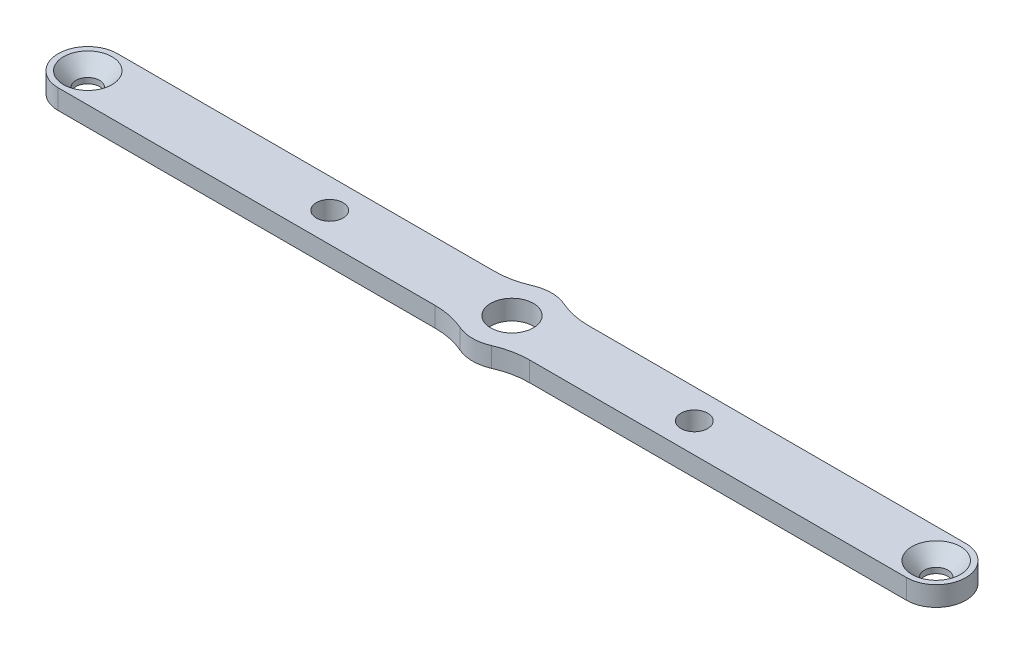
ISO-10303-21;
HEADER;
FILE_DESCRIPTION(('STEP AP214'),'2;1');
FILE_NAME('part.step','',(''),(''),'','','');
FILE_SCHEMA(('AUTOMOTIVE_DESIGN { 1 0 10303 214 1 1 1 1 }'));
ENDSEC;
DATA;
#1=APPLICATION_CONTEXT('core data for automotive mechanical design processes');
#2=APPLICATION_PROTOCOL_DEFINITION('international standard','automotive_design',2000,#1);
#3=PRODUCT_CONTEXT('',#1,'mechanical');
#4=PRODUCT('Part','Part','',(#3));
#5=PRODUCT_RELATED_PRODUCT_CATEGORY('part','',(#4));
#6=PRODUCT_DEFINITION_FORMATION('','',#4);
#7=PRODUCT_DEFINITION_CONTEXT('part definition',#1,'design');
#8=PRODUCT_DEFINITION('design','',#6,#7);
#9=PRODUCT_DEFINITION_SHAPE('','',#8);
#10=(LENGTH_UNIT() NAMED_UNIT(*) SI_UNIT(.MILLI.,.METRE.));
#11=(NAMED_UNIT(*) PLANE_ANGLE_UNIT() SI_UNIT($,.RADIAN.));
#12=(NAMED_UNIT(*) SI_UNIT($,.STERADIAN.) SOLID_ANGLE_UNIT());
#13=UNCERTAINTY_MEASURE_WITH_UNIT(LENGTH_MEASURE(1.E-05),#10,'distance_accuracy_value','');
#14=(GEOMETRIC_REPRESENTATION_CONTEXT(3) GLOBAL_UNCERTAINTY_ASSIGNED_CONTEXT((#13)) GLOBAL_UNIT_ASSIGNED_CONTEXT((#10,
#11,#12)) REPRESENTATION_CONTEXT('',''));
#15=CARTESIAN_POINT('',(0.,0.,0.));
#16=DIRECTION('',(0.,0.,1.));
#17=DIRECTION('',(1.,0.,0.));
#18=AXIS2_PLACEMENT_3D('',#15,#16,#17);
#19=CARTESIAN_POINT('',(-68.2625000000001,3.175,0.));
#20=DIRECTION('',(0.,-1.,0.));
#21=DIRECTION('',(0.,0.,-1.));
#22=AXIS2_PLACEMENT_3D('',#19,#20,#21);
#23=CYLINDRICAL_SURFACE('',#22,1.90500000000001);
#24=CARTESIAN_POINT('',(-68.2625000000001,0.881280432842019,0.));
#25=DIRECTION('',(0.,1.,0.));
#26=DIRECTION('',(0.,0.,1.));
#27=AXIS2_PLACEMENT_3D('',#24,#25,#26);
#28=CIRCLE('',#27,1.90500000000001);
#29=CARTESIAN_POINT('',(-68.2625000000001,0.881280432842019,1.90500000000001));
#30=VERTEX_POINT('',#29);
#31=EDGE_CURVE('E422',#30,#30,#28,.F.);
#32=ORIENTED_EDGE('',*,*,#31,.F.);
#33=EDGE_LOOP('',(#32));
#34=FACE_BOUND('',#33,.T.);
#35=CARTESIAN_POINT('',(-68.2625000000001,0.,0.));
#36=DIRECTION('',(0.,1.,0.));
#37=DIRECTION('',(0.,0.,1.));
#38=AXIS2_PLACEMENT_3D('',#35,#36,#37);
#39=CIRCLE('',#38,1.90500000000001);
#40=CARTESIAN_POINT('',(-68.2625000000001,0.,1.90500000000001));
#41=VERTEX_POINT('',#40);
#42=EDGE_CURVE('E444',#41,#41,#39,.T.);
#43=ORIENTED_EDGE('',*,*,#42,.F.);
#44=EDGE_LOOP('',(#43));
#45=FACE_BOUND('',#44,.T.);
#46=ADVANCED_FACE('F283',(#34,#45),#23,.F.);
#47=CARTESIAN_POINT('',(-29.337,3.175,0.));
#48=DIRECTION('',(0.,-1.,0.));
#49=DIRECTION('',(0.,0.,-1.));
#50=AXIS2_PLACEMENT_3D('',#47,#48,#49);
#51=CYLINDRICAL_SURFACE('',#50,2.15172289740133);
#52=CARTESIAN_POINT('',(-29.337,3.175,0.));
#53=DIRECTION('',(0.,1.,0.));
#54=DIRECTION('',(0.,0.,1.));
#55=AXIS2_PLACEMENT_3D('',#52,#53,#54);
#56=CIRCLE('',#55,2.15172289740133);
#57=CARTESIAN_POINT('',(-29.337,3.175,2.15172289740133));
#58=VERTEX_POINT('',#57);
#59=EDGE_CURVE('E411',#58,#58,#56,.T.);
#60=ORIENTED_EDGE('',*,*,#59,.T.);
#61=EDGE_LOOP('',(#60));
#62=FACE_BOUND('',#61,.T.);
#63=CARTESIAN_POINT('',(-29.337,0.,0.));
#64=DIRECTION('',(0.,1.,0.));
#65=DIRECTION('',(0.,0.,1.));
#66=AXIS2_PLACEMENT_3D('',#63,#64,#65);
#67=CIRCLE('',#66,2.15172289740133);
#68=CARTESIAN_POINT('',(-29.337,0.,2.15172289740133));
#69=VERTEX_POINT('',#68);
#70=EDGE_CURVE('E441',#69,#69,#67,.T.);
#71=ORIENTED_EDGE('',*,*,#70,.F.);
#72=EDGE_LOOP('',(#71));
#73=FACE_BOUND('',#72,.T.);
#74=ADVANCED_FACE('F525',(#62,#73),#51,.F.);
#75=CARTESIAN_POINT('',(0.,3.175,0.));
#76=DIRECTION('',(0.,-1.,0.));
#77=DIRECTION('',(0.,0.,-1.));
#78=AXIS2_PLACEMENT_3D('',#75,#76,#77);
#79=CYLINDRICAL_SURFACE('',#78,3.429);
#80=CARTESIAN_POINT('',(0.,3.175,0.));
#81=DIRECTION('',(0.,1.,0.));
#82=DIRECTION('',(0.,0.,1.));
#83=AXIS2_PLACEMENT_3D('',#80,#81,#82);
#84=CIRCLE('',#83,3.429);
#85=CARTESIAN_POINT('',(0.,3.175,3.429));
#86=VERTEX_POINT('',#85);
#87=EDGE_CURVE('E453',#86,#86,#84,.T.);
#88=ORIENTED_EDGE('',*,*,#87,.T.);
#89=EDGE_LOOP('',(#88));
#90=FACE_BOUND('',#89,.T.);
#91=CARTESIAN_POINT('',(0.,0.,0.));
#92=DIRECTION('',(0.,1.,0.));
#93=DIRECTION('',(0.,0.,1.));
#94=AXIS2_PLACEMENT_3D('',#91,#92,#93);
#95=CIRCLE('',#94,3.429);
#96=CARTESIAN_POINT('',(0.,0.,3.429));
#97=VERTEX_POINT('',#96);
#98=EDGE_CURVE('E418',#97,#97,#95,.T.);
#99=ORIENTED_EDGE('',*,*,#98,.F.);
#100=EDGE_LOOP('',(#99));
#101=FACE_BOUND('',#100,.T.);
#102=ADVANCED_FACE('F531',(#90,#101),#79,.F.);
#103=CARTESIAN_POINT('',(68.2625000000001,3.175,0.));
#104=DIRECTION('',(0.,-1.,0.));
#105=DIRECTION('',(0.,0.,-1.));
#106=AXIS2_PLACEMENT_3D('',#103,#104,#105);
#107=CYLINDRICAL_SURFACE('',#106,1.90500000000001);
#108=CARTESIAN_POINT('',(68.2625000000001,0.881280432842019,0.));
#109=DIRECTION('',(0.,1.,0.));
#110=DIRECTION('',(0.,0.,1.));
#111=AXIS2_PLACEMENT_3D('',#108,#109,#110);
#112=CIRCLE('',#111,1.90500000000001);
#113=CARTESIAN_POINT('',(68.2625000000001,0.881280432842019,1.90500000000001));
#114=VERTEX_POINT('',#113);
#115=EDGE_CURVE('E594',#114,#114,#112,.T.);
#116=ORIENTED_EDGE('',*,*,#115,.T.);
#117=EDGE_LOOP('',(#116));
#118=FACE_BOUND('',#117,.T.);
#119=CARTESIAN_POINT('',(68.2625000000001,0.,0.));
#120=DIRECTION('',(0.,1.,0.));
#121=DIRECTION('',(0.,0.,1.));
#122=AXIS2_PLACEMENT_3D('',#119,#120,#121);
#123=CIRCLE('',#122,1.90500000000001);
#124=CARTESIAN_POINT('',(68.2625000000001,0.,1.90500000000001));
#125=VERTEX_POINT('',#124);
#126=EDGE_CURVE('E450',#125,#125,#123,.F.);
#127=ORIENTED_EDGE('',*,*,#126,.T.);
#128=EDGE_LOOP('',(#127));
#129=FACE_BOUND('',#128,.T.);
#130=ADVANCED_FACE('F560',(#118,#129),#107,.F.);
#131=CARTESIAN_POINT('',(29.337,3.175,0.));
#132=DIRECTION('',(0.,-1.,0.));
#133=DIRECTION('',(0.,0.,-1.));
#134=AXIS2_PLACEMENT_3D('',#131,#132,#133);
#135=CYLINDRICAL_SURFACE('',#134,2.15172289740133);
#136=CARTESIAN_POINT('',(29.337,3.175,0.));
#137=DIRECTION('',(0.,1.,0.));
#138=DIRECTION('',(0.,0.,1.));
#139=AXIS2_PLACEMENT_3D('',#136,#137,#138);
#140=CIRCLE('',#139,2.15172289740133);
#141=CARTESIAN_POINT('',(29.337,3.175,2.15172289740133));
#142=VERTEX_POINT('',#141);
#143=EDGE_CURVE('E414',#142,#142,#140,.F.);
#144=ORIENTED_EDGE('',*,*,#143,.F.);
#145=EDGE_LOOP('',(#144));
#146=FACE_BOUND('',#145,.T.);
#147=CARTESIAN_POINT('',(29.337,0.,0.));
#148=DIRECTION('',(0.,1.,0.));
#149=DIRECTION('',(0.,0.,1.));
#150=AXIS2_PLACEMENT_3D('',#147,#148,#149);
#151=CIRCLE('',#150,2.15172289740133);
#152=CARTESIAN_POINT('',(29.337,0.,2.15172289740133));
#153=VERTEX_POINT('',#152);
#154=EDGE_CURVE('E447',#153,#153,#151,.F.);
#155=ORIENTED_EDGE('',*,*,#154,.T.);
#156=EDGE_LOOP('',(#155));
#157=FACE_BOUND('',#156,.T.);
#158=ADVANCED_FACE('F537',(#146,#157),#135,.F.);
#159=CARTESIAN_POINT('',(0.,3.175,-4.76250000000001));
#160=DIRECTION('',(0.,0.,-1.));
#161=DIRECTION('',(-1.,0.,0.));
#162=AXIS2_PLACEMENT_3D('',#159,#160,#161);
#163=PLANE('',#162);
#164=DIRECTION('',(1.,0.,0.));
#165=VECTOR('',#164,1.);
#166=CARTESIAN_POINT('',(0.,3.175,-4.76250000000001));
#167=LINE('',#166,#165);
#168=CARTESIAN_POINT('',(-68.2625000000001,3.175,-4.7625));
#169=VERTEX_POINT('',#168);
#170=CARTESIAN_POINT('',(-7.6133825432589,3.175,-4.76250000000001));
#171=VERTEX_POINT('',#170);
#172=EDGE_CURVE('E406',#169,#171,#167,.T.);
#173=ORIENTED_EDGE('',*,*,#172,.T.);
#174=DIRECTION('',(0.,-1.,0.));
#175=VECTOR('',#174,1.);
#176=CARTESIAN_POINT('',(-7.6133825432589,3.175,-4.76250000000001));
#177=LINE('',#176,#175);
#178=CARTESIAN_POINT('',(-7.6133825432589,0.,-4.76250000000001));
#179=VERTEX_POINT('',#178);
#180=EDGE_CURVE('E467',#171,#179,#177,.T.);
#181=ORIENTED_EDGE('',*,*,#180,.T.);
#182=DIRECTION('',(1.,0.,0.));
#183=VECTOR('',#182,1.);
#184=CARTESIAN_POINT('',(0.,0.,-4.76250000000001));
#185=LINE('',#184,#183);
#186=CARTESIAN_POINT('',(-68.2625000000001,0.,-4.7625));
#187=VERTEX_POINT('',#186);
#188=EDGE_CURVE('E436',#187,#179,#185,.T.);
#189=ORIENTED_EDGE('',*,*,#188,.F.);
#190=DIRECTION('',(0.,-1.,0.));
#191=VECTOR('',#190,1.);
#192=CARTESIAN_POINT('',(-68.2625000000001,3.175,-4.7625));
#193=LINE('',#192,#191);
#194=EDGE_CURVE('E456',#169,#187,#193,.T.);
#195=ORIENTED_EDGE('',*,*,#194,.F.);
#196=EDGE_LOOP('',(#173,#181,#189,#195));
#197=FACE_BOUND('',#196,.T.);
#198=ADVANCED_FACE('F493',(#197),#163,.T.);
#199=CARTESIAN_POINT('',(0.,3.175,-4.76250000000001));
#200=DIRECTION('',(0.,0.,-1.));
#201=DIRECTION('',(-1.,0.,0.));
#202=AXIS2_PLACEMENT_3D('',#199,#200,#201);
#203=PLANE('',#202);
#204=DIRECTION('',(1.,0.,0.));
#205=VECTOR('',#204,1.);
#206=CARTESIAN_POINT('',(0.,0.,-4.76250000000001));
#207=LINE('',#206,#205);
#208=CARTESIAN_POINT('',(7.6133825432589,0.,-4.76250000000002));
#209=VERTEX_POINT('',#208);
#210=CARTESIAN_POINT('',(68.2625000000001,0.,-4.76250000000003));
#211=VERTEX_POINT('',#210);
#212=EDGE_CURVE('E431',#209,#211,#207,.T.);
#213=ORIENTED_EDGE('',*,*,#212,.F.);
#214=DIRECTION('',(0.,-1.,0.));
#215=VECTOR('',#214,1.);
#216=CARTESIAN_POINT('',(7.6133825432589,3.175,-4.76250000000002));
#217=LINE('',#216,#215);
#218=CARTESIAN_POINT('',(7.6133825432589,3.175,-4.76250000000002));
#219=VERTEX_POINT('',#218);
#220=EDGE_CURVE('E298',#209,#219,#217,.F.);
#221=ORIENTED_EDGE('',*,*,#220,.T.);
#222=DIRECTION('',(1.,0.,0.));
#223=VECTOR('',#222,1.);
#224=CARTESIAN_POINT('',(0.,3.175,-4.76250000000001));
#225=LINE('',#224,#223);
#226=CARTESIAN_POINT('',(68.2625000000001,3.175,-4.76250000000003));
#227=VERTEX_POINT('',#226);
#228=EDGE_CURVE('E398',#219,#227,#225,.T.);
#229=ORIENTED_EDGE('',*,*,#228,.T.);
#230=DIRECTION('',(0.,-1.,0.));
#231=VECTOR('',#230,1.);
#232=CARTESIAN_POINT('',(68.2625000000001,3.175,-4.76250000000003));
#233=LINE('',#232,#231);
#234=EDGE_CURVE('E394',#227,#211,#233,.T.);
#235=ORIENTED_EDGE('',*,*,#234,.T.);
#236=EDGE_LOOP('',(#213,#221,#229,#235));
#237=FACE_BOUND('',#236,.T.);
#238=ADVANCED_FACE('F505',(#237),#203,.T.);
#239=CARTESIAN_POINT('',(68.2625000000001,3.175,0.));
#240=DIRECTION('',(0.,-1.,0.));
#241=DIRECTION('',(0.,0.,-1.));
#242=AXIS2_PLACEMENT_3D('',#239,#240,#241);
#243=CYLINDRICAL_SURFACE('',#242,4.7625);
#244=CARTESIAN_POINT('',(68.2625000000001,0.,0.));
#245=DIRECTION('',(0.,1.,0.));
#246=DIRECTION('',(0.,0.,1.));
#247=AXIS2_PLACEMENT_3D('',#244,#245,#246);
#248=CIRCLE('',#247,4.7625);
#249=CARTESIAN_POINT('',(68.2625000000001,0.,4.76249999999998));
#250=VERTEX_POINT('',#249);
#251=EDGE_CURVE('E429',#250,#211,#248,.T.);
#252=ORIENTED_EDGE('',*,*,#251,.T.);
#253=ORIENTED_EDGE('',*,*,#234,.F.);
#254=CARTESIAN_POINT('',(68.2625000000001,3.175,0.));
#255=DIRECTION('',(0.,1.,0.));
#256=DIRECTION('',(0.,0.,1.));
#257=AXIS2_PLACEMENT_3D('',#254,#255,#256);
#258=CIRCLE('',#257,4.7625);
#259=CARTESIAN_POINT('',(68.2625000000001,3.175,4.76249999999998));
#260=VERTEX_POINT('',#259);
#261=EDGE_CURVE('E375',#260,#227,#258,.T.);
#262=ORIENTED_EDGE('',*,*,#261,.F.);
#263=DIRECTION('',(0.,-1.,0.));
#264=VECTOR('',#263,1.);
#265=CARTESIAN_POINT('',(68.2625000000001,3.175,4.76249999999998));
#266=LINE('',#265,#264);
#267=EDGE_CURVE('E386',#260,#250,#266,.T.);
#268=ORIENTED_EDGE('',*,*,#267,.T.);
#269=EDGE_LOOP('',(#252,#253,#262,#268));
#270=FACE_BOUND('',#269,.T.);
#271=ADVANCED_FACE('F396',(#270),#243,.T.);
#272=CARTESIAN_POINT('',(0.,3.175,4.76249999999999));
#273=DIRECTION('',(0.,0.,-1.));
#274=DIRECTION('',(-1.,0.,0.));
#275=AXIS2_PLACEMENT_3D('',#272,#273,#274);
#276=PLANE('',#275);
#277=DIRECTION('',(1.,0.,0.));
#278=VECTOR('',#277,1.);
#279=CARTESIAN_POINT('',(0.,0.,4.76249999999999));
#280=LINE('',#279,#278);
#281=CARTESIAN_POINT('',(-68.2625000000001,0.,4.7625));
#282=VERTEX_POINT('',#281);
#283=CARTESIAN_POINT('',(-7.61338254325898,0.,4.76249999999999));
#284=VERTEX_POINT('',#283);
#285=EDGE_CURVE('E421',#282,#284,#280,.T.);
#286=ORIENTED_EDGE('',*,*,#285,.T.);
#287=DIRECTION('',(0.,1.,0.));
#288=VECTOR('',#287,1.);
#289=CARTESIAN_POINT('',(-7.61338254325898,3.175,4.76249999999999));
#290=LINE('',#289,#288);
#291=CARTESIAN_POINT('',(-7.61338254325898,3.175,4.76249999999999));
#292=VERTEX_POINT('',#291);
#293=EDGE_CURVE('E463',#284,#292,#290,.T.);
#294=ORIENTED_EDGE('',*,*,#293,.T.);
#295=DIRECTION('',(1.,0.,0.));
#296=VECTOR('',#295,1.);
#297=CARTESIAN_POINT('',(0.,3.175,4.76249999999999));
#298=LINE('',#297,#296);
#299=CARTESIAN_POINT('',(-68.2625000000001,3.175,4.7625));
#300=VERTEX_POINT('',#299);
#301=EDGE_CURVE('E604',#300,#292,#298,.T.);
#302=ORIENTED_EDGE('',*,*,#301,.F.);
#303=DIRECTION('',(0.,-1.,0.));
#304=VECTOR('',#303,1.);
#305=CARTESIAN_POINT('',(-68.2625000000001,3.175,4.7625));
#306=LINE('',#305,#304);
#307=EDGE_CURVE('E417',#300,#282,#306,.T.);
#308=ORIENTED_EDGE('',*,*,#307,.T.);
#309=EDGE_LOOP('',(#286,#294,#302,#308));
#310=FACE_BOUND('',#309,.T.);
#311=ADVANCED_FACE('F551',(#310),#276,.F.);
#312=CARTESIAN_POINT('',(0.,3.175,4.76249999999999));
#313=DIRECTION('',(0.,0.,-1.));
#314=DIRECTION('',(-1.,0.,0.));
#315=AXIS2_PLACEMENT_3D('',#312,#313,#314);
#316=PLANE('',#315);
#317=DIRECTION('',(1.,0.,0.));
#318=VECTOR('',#317,1.);
#319=CARTESIAN_POINT('',(0.,3.175,4.76249999999999));
#320=LINE('',#319,#318);
#321=CARTESIAN_POINT('',(7.61338254325898,3.175,4.76249999999999));
#322=VERTEX_POINT('',#321);
#323=EDGE_CURVE('E370',#322,#260,#320,.T.);
#324=ORIENTED_EDGE('',*,*,#323,.F.);
#325=DIRECTION('',(0.,1.,0.));
#326=VECTOR('',#325,1.);
#327=CARTESIAN_POINT('',(7.61338254325898,0.,4.76249999999999));
#328=LINE('',#327,#326);
#329=CARTESIAN_POINT('',(7.61338254325898,0.,4.76249999999999));
#330=VERTEX_POINT('',#329);
#331=EDGE_CURVE('E465',#322,#330,#328,.F.);
#332=ORIENTED_EDGE('',*,*,#331,.T.);
#333=DIRECTION('',(1.,0.,0.));
#334=VECTOR('',#333,1.);
#335=CARTESIAN_POINT('',(0.,0.,4.76249999999999));
#336=LINE('',#335,#334);
#337=EDGE_CURVE('E389',#330,#250,#336,.T.);
#338=ORIENTED_EDGE('',*,*,#337,.T.);
#339=ORIENTED_EDGE('',*,*,#267,.F.);
#340=EDGE_LOOP('',(#324,#332,#338,#339));
#341=FACE_BOUND('',#340,.T.);
#342=ADVANCED_FACE('F387',(#341),#316,.F.);
#343=CARTESIAN_POINT('',(-68.2625000000001,3.175,0.));
#344=DIRECTION('',(0.,-1.,0.));
#345=DIRECTION('',(0.,0.,-1.));
#346=AXIS2_PLACEMENT_3D('',#343,#344,#345);
#347=CYLINDRICAL_SURFACE('',#346,4.7625);
#348=CARTESIAN_POINT('',(-68.2625000000001,0.,0.));
#349=DIRECTION('',(0.,1.,0.));
#350=DIRECTION('',(0.,0.,1.));
#351=AXIS2_PLACEMENT_3D('',#348,#349,#350);
#352=CIRCLE('',#351,4.7625);
#353=EDGE_CURVE('E439',#187,#282,#352,.T.);
#354=ORIENTED_EDGE('',*,*,#353,.T.);
#355=ORIENTED_EDGE('',*,*,#307,.F.);
#356=CARTESIAN_POINT('',(-68.2625000000001,3.175,0.));
#357=DIRECTION('',(0.,1.,0.));
#358=DIRECTION('',(0.,0.,1.));
#359=AXIS2_PLACEMENT_3D('',#356,#357,#358);
#360=CIRCLE('',#359,4.7625);
#361=EDGE_CURVE('E409',#169,#300,#360,.T.);
#362=ORIENTED_EDGE('',*,*,#361,.F.);
#363=ORIENTED_EDGE('',*,*,#194,.T.);
#364=EDGE_LOOP('',(#354,#355,#362,#363));
#365=FACE_BOUND('',#364,.T.);
#366=ADVANCED_FACE('F523',(#365),#347,.T.);
#367=CARTESIAN_POINT('',(0.,3.175,0.));
#368=DIRECTION('',(0.,-1.,0.));
#369=DIRECTION('',(0.,0.,-1.));
#370=AXIS2_PLACEMENT_3D('',#367,#368,#369);
#371=CYLINDRICAL_SURFACE('',#370,6.35);
#372=CARTESIAN_POINT('',(0.,0.,0.));
#373=DIRECTION('',(0.,1.,0.));
#374=DIRECTION('',(0.,0.,1.));
#375=AXIS2_PLACEMENT_3D('',#372,#373,#374);
#376=CIRCLE('',#375,6.35);
#377=CARTESIAN_POINT('',(2.5377941810863,0.,-5.82083333333334));
#378=VERTEX_POINT('',#377);
#379=CARTESIAN_POINT('',(-2.5377941810863,0.,-5.82083333333333));
#380=VERTEX_POINT('',#379);
#381=EDGE_CURVE('E433',#378,#380,#376,.T.);
#382=ORIENTED_EDGE('',*,*,#381,.T.);
#383=DIRECTION('',(0.,-1.,0.));
#384=VECTOR('',#383,1.);
#385=CARTESIAN_POINT('',(-2.5377941810863,3.175,-5.82083333333333));
#386=LINE('',#385,#384);
#387=CARTESIAN_POINT('',(-2.5377941810863,3.175,-5.82083333333333));
#388=VERTEX_POINT('',#387);
#389=EDGE_CURVE('E473',#380,#388,#386,.F.);
#390=ORIENTED_EDGE('',*,*,#389,.T.);
#391=CARTESIAN_POINT('',(0.,3.175,0.));
#392=DIRECTION('',(0.,1.,0.));
#393=DIRECTION('',(0.,0.,1.));
#394=AXIS2_PLACEMENT_3D('',#391,#392,#393);
#395=CIRCLE('',#394,6.35);
#396=CARTESIAN_POINT('',(2.5377941810863,3.175,-5.82083333333334));
#397=VERTEX_POINT('',#396);
#398=EDGE_CURVE('E400',#397,#388,#395,.T.);
#399=ORIENTED_EDGE('',*,*,#398,.F.);
#400=DIRECTION('',(0.,-1.,0.));
#401=VECTOR('',#400,1.);
#402=CARTESIAN_POINT('',(2.5377941810863,3.175,-5.82083333333334));
#403=LINE('',#402,#401);
#404=EDGE_CURVE('E470',#397,#378,#403,.T.);
#405=ORIENTED_EDGE('',*,*,#404,.T.);
#406=EDGE_LOOP('',(#382,#390,#399,#405));
#407=FACE_BOUND('',#406,.T.);
#408=ADVANCED_FACE('F501',(#407),#371,.T.);
#409=CARTESIAN_POINT('',(0.,0.,0.));
#410=DIRECTION('',(0.,1.,0.));
#411=DIRECTION('',(0.,0.,1.));
#412=AXIS2_PLACEMENT_3D('',#409,#410,#411);
#413=PLANE('',#412);
#414=ORIENTED_EDGE('',*,*,#381,.F.);
#415=CARTESIAN_POINT('',(7.6133825432589,0.,-17.4625));
#416=DIRECTION('',(0.,1.,0.));
#417=DIRECTION('',(0.,0.,1.));
#418=AXIS2_PLACEMENT_3D('',#415,#416,#417);
#419=CIRCLE('',#418,12.7);
#420=EDGE_CURVE('E291',#378,#209,#419,.T.);
#421=ORIENTED_EDGE('',*,*,#420,.T.);
#422=ORIENTED_EDGE('',*,*,#212,.T.);
#423=ORIENTED_EDGE('',*,*,#251,.F.);
#424=ORIENTED_EDGE('',*,*,#337,.F.);
#425=CARTESIAN_POINT('',(7.61338254325898,0.,17.4625));
#426=DIRECTION('',(0.,1.,0.));
#427=DIRECTION('',(0.,0.,1.));
#428=AXIS2_PLACEMENT_3D('',#425,#426,#427);
#429=CIRCLE('',#428,12.7);
#430=CARTESIAN_POINT('',(2.53779418108633,0.,5.82083333333333));
#431=VERTEX_POINT('',#430);
#432=EDGE_CURVE('E480',#330,#431,#429,.T.);
#433=ORIENTED_EDGE('',*,*,#432,.T.);
#434=CARTESIAN_POINT('',(0.,0.,0.));
#435=DIRECTION('',(0.,1.,0.));
#436=DIRECTION('',(0.,0.,1.));
#437=AXIS2_PLACEMENT_3D('',#434,#435,#436);
#438=CIRCLE('',#437,6.35);
#439=CARTESIAN_POINT('',(-2.53779418108633,0.,5.82083333333333));
#440=VERTEX_POINT('',#439);
#441=EDGE_CURVE('E425',#440,#431,#438,.T.);
#442=ORIENTED_EDGE('',*,*,#441,.F.);
#443=CARTESIAN_POINT('',(-7.61338254325898,0.,17.4625));
#444=DIRECTION('',(0.,1.,0.));
#445=DIRECTION('',(0.,0.,1.));
#446=AXIS2_PLACEMENT_3D('',#443,#444,#445);
#447=CIRCLE('',#446,12.7);
#448=EDGE_CURVE('E476',#440,#284,#447,.T.);
#449=ORIENTED_EDGE('',*,*,#448,.T.);
#450=ORIENTED_EDGE('',*,*,#285,.F.);
#451=ORIENTED_EDGE('',*,*,#353,.F.);
#452=ORIENTED_EDGE('',*,*,#188,.T.);
#453=CARTESIAN_POINT('',(-7.61338254325891,0.,-17.4625));
#454=DIRECTION('',(0.,1.,0.));
#455=DIRECTION('',(0.,0.,1.));
#456=AXIS2_PLACEMENT_3D('',#453,#454,#455);
#457=CIRCLE('',#456,12.7);
#458=EDGE_CURVE('E483',#179,#380,#457,.T.);
#459=ORIENTED_EDGE('',*,*,#458,.T.);
#460=EDGE_LOOP('',(#414,#421,#422,#423,#424,#433,#442,#449,#450,#451,#452,#459));
#461=FACE_BOUND('',#460,.T.);
#462=ORIENTED_EDGE('',*,*,#126,.F.);
#463=EDGE_LOOP('',(#462));
#464=FACE_BOUND('',#463,.T.);
#465=ORIENTED_EDGE('',*,*,#154,.F.);
#466=EDGE_LOOP('',(#465));
#467=FACE_BOUND('',#466,.T.);
#468=ORIENTED_EDGE('',*,*,#42,.T.);
#469=EDGE_LOOP('',(#468));
#470=FACE_BOUND('',#469,.T.);
#471=ORIENTED_EDGE('',*,*,#70,.T.);
#472=EDGE_LOOP('',(#471));
#473=FACE_BOUND('',#472,.T.);
#474=ORIENTED_EDGE('',*,*,#98,.T.);
#475=EDGE_LOOP('',(#474));
#476=FACE_BOUND('',#475,.T.);
#477=ADVANCED_FACE('F497',(#461,#464,#467,#470,#473,#476),#413,.F.);
#478=CARTESIAN_POINT('',(0.,3.175,0.));
#479=DIRECTION('',(0.,1.,0.));
#480=DIRECTION('',(0.,0.,1.));
#481=AXIS2_PLACEMENT_3D('',#478,#479,#480);
#482=PLANE('',#481);
#483=CARTESIAN_POINT('',(68.2625000000001,3.175,0.));
#484=DIRECTION('',(0.,1.,0.));
#485=DIRECTION('',(0.,0.,-1.));
#486=AXIS2_PLACEMENT_3D('',#483,#484,#485);
#487=CIRCLE('',#486,3.8989);
#488=CARTESIAN_POINT('',(68.2625000000001,3.175,-3.8989));
#489=VERTEX_POINT('',#488);
#490=EDGE_CURVE('E591',#489,#489,#487,.T.);
#491=ORIENTED_EDGE('',*,*,#490,.F.);
#492=EDGE_LOOP('',(#491));
#493=FACE_BOUND('',#492,.T.);
#494=CARTESIAN_POINT('',(-68.2625000000001,3.175,0.));
#495=DIRECTION('',(0.,-1.,0.));
#496=DIRECTION('',(0.,0.,-1.));
#497=AXIS2_PLACEMENT_3D('',#494,#495,#496);
#498=CIRCLE('',#497,3.8989);
#499=CARTESIAN_POINT('',(-68.2625000000001,3.175,-3.8989));
#500=VERTEX_POINT('',#499);
#501=EDGE_CURVE('E595',#500,#500,#498,.T.);
#502=ORIENTED_EDGE('',*,*,#501,.T.);
#503=EDGE_LOOP('',(#502));
#504=FACE_BOUND('',#503,.T.);
#505=ORIENTED_EDGE('',*,*,#228,.F.);
#506=CARTESIAN_POINT('',(7.6133825432589,3.175,-17.4625));
#507=DIRECTION('',(0.,1.,0.));
#508=DIRECTION('',(0.,0.,1.));
#509=AXIS2_PLACEMENT_3D('',#506,#507,#508);
#510=CIRCLE('',#509,12.7);
#511=EDGE_CURVE('E12',#219,#397,#510,.F.);
#512=ORIENTED_EDGE('',*,*,#511,.T.);
#513=ORIENTED_EDGE('',*,*,#398,.T.);
#514=CARTESIAN_POINT('',(-7.61338254325891,3.175,-17.4625));
#515=DIRECTION('',(0.,1.,0.));
#516=DIRECTION('',(0.,0.,1.));
#517=AXIS2_PLACEMENT_3D('',#514,#515,#516);
#518=CIRCLE('',#517,12.7);
#519=EDGE_CURVE('E485',#388,#171,#518,.F.);
#520=ORIENTED_EDGE('',*,*,#519,.T.);
#521=ORIENTED_EDGE('',*,*,#172,.F.);
#522=ORIENTED_EDGE('',*,*,#361,.T.);
#523=ORIENTED_EDGE('',*,*,#301,.T.);
#524=CARTESIAN_POINT('',(-7.61338254325898,3.175,17.4625));
#525=DIRECTION('',(0.,1.,0.));
#526=DIRECTION('',(0.,0.,1.));
#527=AXIS2_PLACEMENT_3D('',#524,#525,#526);
#528=CIRCLE('',#527,12.7);
#529=CARTESIAN_POINT('',(-2.53779418108633,3.175,5.82083333333333));
#530=VERTEX_POINT('',#529);
#531=EDGE_CURVE('E478',#292,#530,#528,.F.);
#532=ORIENTED_EDGE('',*,*,#531,.T.);
#533=CARTESIAN_POINT('',(0.,3.175,0.));
#534=DIRECTION('',(0.,1.,0.));
#535=DIRECTION('',(0.,0.,1.));
#536=AXIS2_PLACEMENT_3D('',#533,#534,#535);
#537=CIRCLE('',#536,6.35);
#538=CARTESIAN_POINT('',(2.53779418108633,3.175,5.82083333333333));
#539=VERTEX_POINT('',#538);
#540=EDGE_CURVE('E383',#530,#539,#537,.T.);
#541=ORIENTED_EDGE('',*,*,#540,.T.);
#542=CARTESIAN_POINT('',(7.61338254325898,3.175,17.4625));
#543=DIRECTION('',(0.,1.,0.));
#544=DIRECTION('',(0.,0.,1.));
#545=AXIS2_PLACEMENT_3D('',#542,#543,#544);
#546=CIRCLE('',#545,12.7);
#547=EDGE_CURVE('E379',#539,#322,#546,.F.);
#548=ORIENTED_EDGE('',*,*,#547,.T.);
#549=ORIENTED_EDGE('',*,*,#323,.T.);
#550=ORIENTED_EDGE('',*,*,#261,.T.);
#551=EDGE_LOOP('',(#505,#512,#513,#520,#521,#522,#523,#532,#541,#548,#549,#550));
#552=FACE_BOUND('',#551,.T.);
#553=ORIENTED_EDGE('',*,*,#87,.F.);
#554=EDGE_LOOP('',(#553));
#555=FACE_BOUND('',#554,.T.);
#556=ORIENTED_EDGE('',*,*,#59,.F.);
#557=EDGE_LOOP('',(#556));
#558=FACE_BOUND('',#557,.T.);
#559=ORIENTED_EDGE('',*,*,#143,.T.);
#560=EDGE_LOOP('',(#559));
#561=FACE_BOUND('',#560,.T.);
#562=ADVANCED_FACE('F372',(#493,#504,#552,#555,#558,#561),#482,.T.);
#563=CARTESIAN_POINT('',(0.,3.175,0.));
#564=DIRECTION('',(0.,-1.,0.));
#565=DIRECTION('',(0.,0.,-1.));
#566=AXIS2_PLACEMENT_3D('',#563,#564,#565);
#567=CYLINDRICAL_SURFACE('',#566,6.35);
#568=ORIENTED_EDGE('',*,*,#540,.F.);
#569=DIRECTION('',(0.,-1.,0.));
#570=VECTOR('',#569,1.);
#571=CARTESIAN_POINT('',(-2.53779418108633,3.175,5.82083333333333));
#572=LINE('',#571,#570);
#573=EDGE_CURVE('E460',#530,#440,#572,.T.);
#574=ORIENTED_EDGE('',*,*,#573,.T.);
#575=ORIENTED_EDGE('',*,*,#441,.T.);
#576=DIRECTION('',(0.,-1.,0.));
#577=VECTOR('',#576,1.);
#578=CARTESIAN_POINT('',(2.53779418108633,3.175,5.82083333333333));
#579=LINE('',#578,#577);
#580=EDGE_CURVE('E393',#431,#539,#579,.F.);
#581=ORIENTED_EDGE('',*,*,#580,.T.);
#582=EDGE_LOOP('',(#568,#574,#575,#581));
#583=FACE_BOUND('',#582,.T.);
#584=ADVANCED_FACE('F511',(#583),#567,.T.);
#585=CARTESIAN_POINT('',(-7.61338254325898,3.175,17.4625));
#586=DIRECTION('',(0.,-1.,0.));
#587=DIRECTION('',(0.,0.,-1.));
#588=AXIS2_PLACEMENT_3D('',#585,#586,#587);
#589=CYLINDRICAL_SURFACE('',#588,12.7);
#590=ORIENTED_EDGE('',*,*,#531,.F.);
#591=ORIENTED_EDGE('',*,*,#293,.F.);
#592=ORIENTED_EDGE('',*,*,#448,.F.);
#593=ORIENTED_EDGE('',*,*,#573,.F.);
#594=EDGE_LOOP('',(#590,#591,#592,#593));
#595=FACE_BOUND('',#594,.T.);
#596=ADVANCED_FACE('F515',(#595),#589,.F.);
#597=CARTESIAN_POINT('',(7.61338254325898,3.175,17.4625));
#598=DIRECTION('',(0.,-1.,0.));
#599=DIRECTION('',(0.,0.,-1.));
#600=AXIS2_PLACEMENT_3D('',#597,#598,#599);
#601=CYLINDRICAL_SURFACE('',#600,12.7);
#602=ORIENTED_EDGE('',*,*,#547,.F.);
#603=ORIENTED_EDGE('',*,*,#580,.F.);
#604=ORIENTED_EDGE('',*,*,#432,.F.);
#605=ORIENTED_EDGE('',*,*,#331,.F.);
#606=EDGE_LOOP('',(#602,#603,#604,#605));
#607=FACE_BOUND('',#606,.T.);
#608=ADVANCED_FACE('F513',(#607),#601,.F.);
#609=CARTESIAN_POINT('',(-7.61338254325891,3.175,-17.4625));
#610=DIRECTION('',(0.,-1.,0.));
#611=DIRECTION('',(0.,0.,-1.));
#612=AXIS2_PLACEMENT_3D('',#609,#610,#611);
#613=CYLINDRICAL_SURFACE('',#612,12.7);
#614=ORIENTED_EDGE('',*,*,#519,.F.);
#615=ORIENTED_EDGE('',*,*,#389,.F.);
#616=ORIENTED_EDGE('',*,*,#458,.F.);
#617=ORIENTED_EDGE('',*,*,#180,.F.);
#618=EDGE_LOOP('',(#614,#615,#616,#617));
#619=FACE_BOUND('',#618,.T.);
#620=ADVANCED_FACE('F496',(#619),#613,.F.);
#621=CARTESIAN_POINT('',(7.6133825432589,3.175,-17.4625));
#622=DIRECTION('',(0.,-1.,0.));
#623=DIRECTION('',(0.,0.,-1.));
#624=AXIS2_PLACEMENT_3D('',#621,#622,#623);
#625=CYLINDRICAL_SURFACE('',#624,12.7);
#626=ORIENTED_EDGE('',*,*,#511,.F.);
#627=ORIENTED_EDGE('',*,*,#220,.F.);
#628=ORIENTED_EDGE('',*,*,#420,.F.);
#629=ORIENTED_EDGE('',*,*,#404,.F.);
#630=EDGE_LOOP('',(#626,#627,#628,#629));
#631=FACE_BOUND('',#630,.T.);
#632=ADVANCED_FACE('F285',(#631),#625,.F.);
#633=CARTESIAN_POINT('',(-68.2625000000001,0.7112,0.));
#634=DIRECTION('',(0.,1.,0.));
#635=DIRECTION('',(0.,0.,1.));
#636=AXIS2_PLACEMENT_3D('',#633,#634,#635);
#637=CONICAL_SURFACE('',#636,1.7571513353684,0.71558499331767);
#638=ORIENTED_EDGE('',*,*,#31,.T.);
#639=EDGE_LOOP('',(#638));
#640=FACE_BOUND('',#639,.T.);
#641=ORIENTED_EDGE('',*,*,#501,.F.);
#642=EDGE_LOOP('',(#641));
#643=FACE_BOUND('',#642,.T.);
#644=ADVANCED_FACE('F579',(#640,#643),#637,.F.);
#645=CARTESIAN_POINT('',(68.2625000000001,0.7112,0.));
#646=DIRECTION('',(0.,1.,0.));
#647=DIRECTION('',(0.,0.,1.));
#648=AXIS2_PLACEMENT_3D('',#645,#646,#647);
#649=CONICAL_SURFACE('',#648,1.7571513353684,0.71558499331767);
#650=ORIENTED_EDGE('',*,*,#490,.T.);
#651=EDGE_LOOP('',(#650));
#652=FACE_BOUND('',#651,.T.);
#653=ORIENTED_EDGE('',*,*,#115,.F.);
#654=EDGE_LOOP('',(#653));
#655=FACE_BOUND('',#654,.T.);
#656=ADVANCED_FACE('F582',(#652,#655),#649,.F.);
#657=CLOSED_SHELL('',(#46,#74,#102,#130,#158,#198,#238,#271,#311,#342,#366,#408,#477,#562,#584,
#596,#608,#620,#632,#644,#656));
#658=MANIFOLD_SOLID_BREP('B2',#657);
#659=ADVANCED_BREP_SHAPE_REPRESENTATION('',(#18,#658),#14);
#660=SHAPE_DEFINITION_REPRESENTATION(#9,#659);
ENDSEC;
END-ISO-10303-21;
